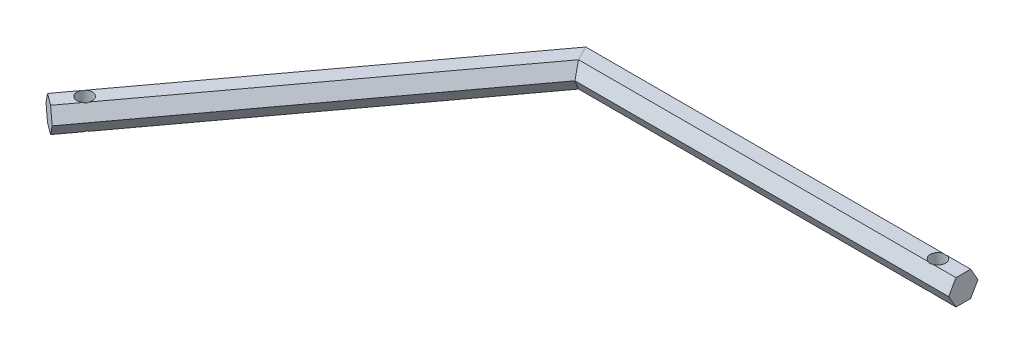
ISO-10303-21;
HEADER;
FILE_DESCRIPTION(('STEP AP214'),'2;1');
FILE_NAME('part.step','',(''),(''),'','','');
FILE_SCHEMA(('AUTOMOTIVE_DESIGN { 1 0 10303 214 1 1 1 1 }'));
ENDSEC;
DATA;
#1=APPLICATION_CONTEXT('core data for automotive mechanical design processes');
#2=APPLICATION_PROTOCOL_DEFINITION('international standard','automotive_design',2000,#1);
#3=PRODUCT_CONTEXT('',#1,'mechanical');
#4=PRODUCT('Part','Part','',(#3));
#5=PRODUCT_RELATED_PRODUCT_CATEGORY('part','',(#4));
#6=PRODUCT_DEFINITION_FORMATION('','',#4);
#7=PRODUCT_DEFINITION_CONTEXT('part definition',#1,'design');
#8=PRODUCT_DEFINITION('design','',#6,#7);
#9=PRODUCT_DEFINITION_SHAPE('','',#8);
#10=(LENGTH_UNIT() NAMED_UNIT(*) SI_UNIT(.MILLI.,.METRE.));
#11=(NAMED_UNIT(*) PLANE_ANGLE_UNIT() SI_UNIT($,.RADIAN.));
#12=(NAMED_UNIT(*) SI_UNIT($,.STERADIAN.) SOLID_ANGLE_UNIT());
#13=UNCERTAINTY_MEASURE_WITH_UNIT(LENGTH_MEASURE(1.E-05),#10,'distance_accuracy_value','');
#14=(GEOMETRIC_REPRESENTATION_CONTEXT(3) GLOBAL_UNCERTAINTY_ASSIGNED_CONTEXT((#13)) GLOBAL_UNIT_ASSIGNED_CONTEXT((#10,
#11,#12)) REPRESENTATION_CONTEXT('',''));
#15=CARTESIAN_POINT('',(0.,0.,0.));
#16=DIRECTION('',(0.,0.,1.));
#17=DIRECTION('',(1.,0.,0.));
#18=AXIS2_PLACEMENT_3D('',#15,#16,#17);
#19=CARTESIAN_POINT('',(-0.356969288863335,-5.,-4.37071207084153));
#20=DIRECTION('',(0.,-1.,0.));
#21=DIRECTION('',(1.,0.,0.));
#22=AXIS2_PLACEMENT_3D('',#19,#20,#21);
#23=PLANE('',#22);
#24=DIRECTION('',(-0.594822786751345,0.,0.803856860617215));
#25=VECTOR('',#24,1.);
#26=CARTESIAN_POINT('',(-0.356969288863335,-5.,-4.37071207084153));
#27=LINE('',#26,#25);
#28=CARTESIAN_POINT('',(-86.0813957911685,-5.,111.479201384409));
#29=VERTEX_POINT('',#28);
#30=CARTESIAN_POINT('',(-91.5439528870381,-5.,118.861423612327));
#31=VERTEX_POINT('',#30);
#32=EDGE_CURVE('E173',#29,#31,#27,.T.);
#33=ORIENTED_EDGE('',*,*,#32,.F.);
#34=CARTESIAN_POINT('',(-83.2751901451892,-5.00000000000106,112.539960486409));
#35=DIRECTION('',(0.,-1.,0.));
#36=DIRECTION('',(0.80385686061721,0.,0.594822786751351));
#37=AXIS2_PLACEMENT_3D('',#34,#35,#36);
#38=CIRCLE('',#37,2.99999999999999);
#39=CARTESIAN_POINT('',(-81.4403260424919,-5.00000000000106,114.913412344913));
#40=VERTEX_POINT('',#39);
#41=EDGE_CURVE('E63',#40,#29,#38,.T.);
#42=ORIENTED_EDGE('',*,*,#41,.F.);
#43=DIRECTION('',(-0.594822786751345,0.,0.803856860617215));
#44=VECTOR('',#43,1.);
#45=CARTESIAN_POINT('',(4.28410045980944,-5.,-0.936501110331403));
#46=LINE('',#45,#44);
#47=CARTESIAN_POINT('',(-86.9028831383654,-5.,122.295634572837));
#48=VERTEX_POINT('',#47);
#49=EDGE_CURVE('E171',#40,#48,#46,.T.);
#50=ORIENTED_EDGE('',*,*,#49,.T.);
#51=DIRECTION('',(0.803856860617215,0.,0.594822786751344));
#52=VECTOR('',#51,1.);
#53=CARTESIAN_POINT('',(-91.5439528870381,-5.,118.861423612327));
#54=LINE('',#53,#52);
#55=EDGE_CURVE('E297',#31,#48,#54,.T.);
#56=ORIENTED_EDGE('',*,*,#55,.F.);
#57=EDGE_LOOP('',(#33,#42,#50,#56));
#58=FACE_BOUND('',#57,.T.);
#59=ADVANCED_FACE('F39',(#58),#23,.T.);
#60=CARTESIAN_POINT('',(4.28410045980944,-5.,-0.936501110331403));
#61=DIRECTION('',(0.696160462300914,-0.5,0.515131644076519));
#62=DIRECTION('',(0.594822786751345,0.,-0.803856860617215));
#63=AXIS2_PLACEMENT_3D('',#60,#61,#62);
#64=PLANE('',#63);
#65=ORIENTED_EDGE('',*,*,#49,.F.);
#66=CARTESIAN_POINT('',(-83.2751901451892,-10.0000000000018,112.539960486409));
#67=DIRECTION('',(0.696160462300914,-0.5,0.515131644076519));
#68=DIRECTION('',(0.401928430308605,0.866025403784439,0.297411393375676));
#69=AXIS2_PLACEMENT_3D('',#66,#67,#68);
#70=ELLIPSE('',#69,5.99999999999997,2.99999999999999);
#71=CARTESIAN_POINT('',(-80.468984499213,-5.00000000000106,113.600719588417));
#72=VERTEX_POINT('',#71);
#73=EDGE_CURVE('E156',#40,#72,#70,.F.);
#74=ORIENTED_EDGE('',*,*,#73,.T.);
#75=CARTESIAN_POINT('',(1.45504246215553,-5.,2.88675134594813));
#76=VERTEX_POINT('',#75);
#77=EDGE_CURVE('E182',#76,#72,#46,.T.);
#78=ORIENTED_EDGE('',*,*,#77,.F.);
#79=DIRECTION('',(-0.244379400918653,-0.839767248292632,-0.484839846858383));
#80=VECTOR('',#79,1.);
#81=CARTESIAN_POINT('',(10.3263391859964,25.4846660993621,20.4870815245707));
#82=LINE('',#81,#80);
#83=CARTESIAN_POINT('',(2.91008492431101,0.,5.77350269189626));
#84=VERTEX_POINT('',#83);
#85=EDGE_CURVE('E196',#84,#76,#82,.T.);
#86=ORIENTED_EDGE('',*,*,#85,.F.);
#87=DIRECTION('',(-0.594822786751345,0.,0.803856860617215));
#88=VECTOR('',#87,1.);
#89=CARTESIAN_POINT('',(6.60463533414582,0.,0.780604369923665));
#90=LINE('',#89,#88);
#91=CARTESIAN_POINT('',(-84.582348264029,0.,124.012740053092));
#92=VERTEX_POINT('',#91);
#93=EDGE_CURVE('E183',#84,#92,#90,.T.);
#94=ORIENTED_EDGE('',*,*,#93,.T.);
#95=DIRECTION('',(0.401928430308607,0.866025403784438,0.297411393375673));
#96=VECTOR('',#95,1.);
#97=CARTESIAN_POINT('',(-86.9028831383654,-5.,122.295634572837));
#98=LINE('',#97,#96);
#99=EDGE_CURVE('E180',#48,#92,#98,.T.);
#100=ORIENTED_EDGE('',*,*,#99,.F.);
#101=EDGE_LOOP('',(#65,#74,#78,#86,#94,#100));
#102=FACE_BOUND('',#101,.T.);
#103=ADVANCED_FACE('F178',(#102),#64,.T.);
#104=CARTESIAN_POINT('',(6.60463533414582,0.,0.780604369923665));
#105=DIRECTION('',(0.696160462300914,0.5,0.515131644076519));
#106=DIRECTION('',(0.594822786751345,0.,-0.803856860617215));
#107=AXIS2_PLACEMENT_3D('',#104,#105,#106);
#108=PLANE('',#107);
#109=DIRECTION('',(-0.594822786751345,0.,0.803856860617215));
#110=VECTOR('',#109,1.);
#111=CARTESIAN_POINT('',(4.28410045980944,5.,-0.936501110331403));
#112=LINE('',#111,#110);
#113=CARTESIAN_POINT('',(1.4550424621555,5.,2.88675134594813));
#114=VERTEX_POINT('',#113);
#115=CARTESIAN_POINT('',(-80.4689844992139,4.99999999999949,113.600719588419));
#116=VERTEX_POINT('',#115);
#117=EDGE_CURVE('E187',#114,#116,#112,.T.);
#118=ORIENTED_EDGE('',*,*,#117,.T.);
#119=CARTESIAN_POINT('',(-83.2751901451892,10.0000000000019,112.539960486409));
#120=DIRECTION('',(0.696160462300914,0.5,0.515131644076519));
#121=DIRECTION('',(-0.40192843030861,0.866025403784439,-0.297411393375669));
#122=AXIS2_PLACEMENT_3D('',#119,#120,#121);
#123=ELLIPSE('',#122,6.00000000000001,2.99999999999999);
#124=CARTESIAN_POINT('',(-81.4403260424901,4.99999999999949,114.913412344911));
#125=VERTEX_POINT('',#124);
#126=EDGE_CURVE('E166',#116,#125,#123,.F.);
#127=ORIENTED_EDGE('',*,*,#126,.T.);
#128=CARTESIAN_POINT('',(-86.9028831383654,5.,122.295634572837));
#129=VERTEX_POINT('',#128);
#130=EDGE_CURVE('E308',#125,#129,#112,.T.);
#131=ORIENTED_EDGE('',*,*,#130,.T.);
#132=DIRECTION('',(-0.401928430308607,0.866025403784438,-0.297411393375673));
#133=VECTOR('',#132,1.);
#134=CARTESIAN_POINT('',(-84.582348264029,0.,124.012740053092));
#135=LINE('',#134,#133);
#136=EDGE_CURVE('E291',#92,#129,#135,.T.);
#137=ORIENTED_EDGE('',*,*,#136,.F.);
#138=ORIENTED_EDGE('',*,*,#93,.F.);
#139=DIRECTION('',(0.244379400918653,-0.839767248292632,0.484839846858383));
#140=VECTOR('',#139,1.);
#141=CARTESIAN_POINT('',(11.6944846329888,-30.1860596413953,23.20143235163));
#142=LINE('',#141,#140);
#143=EDGE_CURVE('E202',#114,#84,#142,.T.);
#144=ORIENTED_EDGE('',*,*,#143,.F.);
#145=EDGE_LOOP('',(#118,#127,#131,#137,#138,#144));
#146=FACE_BOUND('',#145,.T.);
#147=ADVANCED_FACE('F318',(#146),#108,.T.);
#148=CARTESIAN_POINT('',(4.28410045980944,5.,-0.936501110331403));
#149=DIRECTION('',(0.,1.,0.));
#150=DIRECTION('',(-1.,0.,0.));
#151=AXIS2_PLACEMENT_3D('',#148,#149,#150);
#152=PLANE('',#151);
#153=DIRECTION('',(-0.594822786751345,0.,0.803856860617215));
#154=VECTOR('',#153,1.);
#155=CARTESIAN_POINT('',(-0.356969288863321,5.00000000000001,-4.37071207084153));
#156=LINE('',#155,#154);
#157=CARTESIAN_POINT('',(-1.45504246215548,5.00000000000001,-2.88675134594812));
#158=VERTEX_POINT('',#157);
#159=CARTESIAN_POINT('',(-85.1100542478828,5.00000000000001,110.166508627904));
#160=VERTEX_POINT('',#159);
#161=EDGE_CURVE('E305',#158,#160,#156,.T.);
#162=ORIENTED_EDGE('',*,*,#161,.T.);
#163=CARTESIAN_POINT('',(-83.2751901451892,4.99999999999948,112.539960486409));
#164=DIRECTION('',(0.,-1.,0.));
#165=DIRECTION('',(0.80385686061721,0.,0.594822786751351));
#166=AXIS2_PLACEMENT_3D('',#163,#164,#165);
#167=CIRCLE('',#166,2.99999999999999);
#168=EDGE_CURVE('E55',#160,#116,#167,.T.);
#169=ORIENTED_EDGE('',*,*,#168,.T.);
#170=ORIENTED_EDGE('',*,*,#117,.F.);
#171=DIRECTION('',(0.450098441037433,0.,0.892978943411138));
#172=VECTOR('',#171,1.);
#173=CARTESIAN_POINT('',(31.5485584308173,4.99999999999999,62.5911929593927));
#174=LINE('',#173,#172);
#175=EDGE_CURVE('E209',#158,#114,#174,.T.);
#176=ORIENTED_EDGE('',*,*,#175,.F.);
#177=EDGE_LOOP('',(#162,#169,#170,#176));
#178=FACE_BOUND('',#177,.T.);
#179=ADVANCED_FACE('F356',(#178),#152,.T.);
#180=CARTESIAN_POINT('',(-0.356969288863321,5.00000000000001,-4.37071207084153));
#181=DIRECTION('',(-0.696160462300914,0.500000000000001,-0.515131644076518));
#182=DIRECTION('',(-0.594822786751345,0.,0.803856860617215));
#183=AXIS2_PLACEMENT_3D('',#180,#181,#182);
#184=PLANE('',#183);
#185=CARTESIAN_POINT('',(-86.081395791167,4.99999999999948,111.479201384406));
#186=VERTEX_POINT('',#185);
#187=CARTESIAN_POINT('',(-91.5439528870381,5.00000000000001,118.861423612327));
#188=VERTEX_POINT('',#187);
#189=EDGE_CURVE('E304',#186,#188,#156,.T.);
#190=ORIENTED_EDGE('',*,*,#189,.F.);
#191=CARTESIAN_POINT('',(-83.2751901451892,9.99999999999815,112.539960486409));
#192=DIRECTION('',(-0.696160462300914,0.500000000000001,-0.515131644076518));
#193=DIRECTION('',(0.401928430308606,0.866025403784438,0.297411393375677));
#194=AXIS2_PLACEMENT_3D('',#191,#192,#193);
#195=ELLIPSE('',#194,5.99999999999996,2.99999999999999);
#196=EDGE_CURVE('E175',#186,#160,#195,.F.);
#197=ORIENTED_EDGE('',*,*,#196,.T.);
#198=ORIENTED_EDGE('',*,*,#161,.F.);
#199=DIRECTION('',(0.244379400918654,0.839767248292632,0.484839846858384));
#200=VECTOR('',#199,1.);
#201=CARTESIAN_POINT('',(7.59004829201163,36.0818790152958,15.0583798704524));
#202=LINE('',#201,#200);
#203=CARTESIAN_POINT('',(-2.91008492431103,0.,-5.77350269189627));
#204=VERTEX_POINT('',#203);
#205=EDGE_CURVE('E218',#204,#158,#202,.T.);
#206=ORIENTED_EDGE('',*,*,#205,.F.);
#207=DIRECTION('',(-0.594822786751345,0.,0.803856860617215));
#208=VECTOR('',#207,1.);
#209=CARTESIAN_POINT('',(-2.67750416319971,0.,-6.08781755109659));
#210=LINE('',#209,#208);
#211=CARTESIAN_POINT('',(-93.8644877613745,0.,117.144318132072));
#212=VERTEX_POINT('',#211);
#213=EDGE_CURVE('E300',#204,#212,#210,.T.);
#214=ORIENTED_EDGE('',*,*,#213,.T.);
#215=DIRECTION('',(-0.401928430308609,-0.866025403784438,-0.297411393375673));
#216=VECTOR('',#215,1.);
#217=CARTESIAN_POINT('',(-91.5439528870381,5.00000000000001,118.861423612327));
#218=LINE('',#217,#216);
#219=EDGE_CURVE('E284',#188,#212,#218,.T.);
#220=ORIENTED_EDGE('',*,*,#219,.F.);
#221=EDGE_LOOP('',(#190,#197,#198,#206,#214,#220));
#222=FACE_BOUND('',#221,.T.);
#223=ADVANCED_FACE('F359',(#222),#184,.T.);
#224=CARTESIAN_POINT('',(-2.67750416319971,0.,-6.08781755109659));
#225=DIRECTION('',(-0.696160462300914,-0.5,-0.515131644076519));
#226=DIRECTION('',(-0.594822786751345,0.,0.803856860617215));
#227=AXIS2_PLACEMENT_3D('',#224,#225,#226);
#228=PLANE('',#227);
#229=CARTESIAN_POINT('',(-1.45504246215548,-5.,-2.88675134594813));
#230=VERTEX_POINT('',#229);
#231=CARTESIAN_POINT('',(-85.1100542478804,-5.00000000000106,110.166508627901));
#232=VERTEX_POINT('',#231);
#233=EDGE_CURVE('E191',#230,#232,#27,.T.);
#234=ORIENTED_EDGE('',*,*,#233,.T.);
#235=CARTESIAN_POINT('',(-83.2751901451892,-9.9999999999982,112.539960486409));
#236=DIRECTION('',(-0.696160462300914,-0.5,-0.515131644076519));
#237=DIRECTION('',(-0.40192843030861,0.866025403784439,-0.297411393375669));
#238=AXIS2_PLACEMENT_3D('',#235,#236,#237);
#239=ELLIPSE('',#238,6.,2.99999999999999);
#240=EDGE_CURVE('E11',#232,#29,#239,.F.);
#241=ORIENTED_EDGE('',*,*,#240,.T.);
#242=ORIENTED_EDGE('',*,*,#32,.T.);
#243=DIRECTION('',(0.401928430308607,-0.866025403784438,0.297411393375673));
#244=VECTOR('',#243,1.);
#245=CARTESIAN_POINT('',(-93.8644877613745,0.,117.144318132072));
#246=LINE('',#245,#244);
#247=EDGE_CURVE('E280',#212,#31,#246,.T.);
#248=ORIENTED_EDGE('',*,*,#247,.F.);
#249=ORIENTED_EDGE('',*,*,#213,.F.);
#250=DIRECTION('',(-0.244379400918653,0.839767248292632,-0.484839846858383));
#251=VECTOR('',#250,1.);
#252=CARTESIAN_POINT('',(6.22190284501917,-31.3804854732625,12.344029043393));
#253=LINE('',#252,#251);
#254=EDGE_CURVE('E222',#230,#204,#253,.T.);
#255=ORIENTED_EDGE('',*,*,#254,.F.);
#256=EDGE_LOOP('',(#234,#241,#242,#248,#249,#255));
#257=FACE_BOUND('',#256,.T.);
#258=ADVANCED_FACE('F374',(#257),#228,.T.);
#259=CARTESIAN_POINT('',(150.,5.,2.88675134594814));
#260=DIRECTION('',(0.,1.,0.));
#261=DIRECTION('',(0.,0.,1.));
#262=AXIS2_PLACEMENT_3D('',#259,#260,#261);
#263=PLANE('',#262);
#264=CARTESIAN_POINT('',(140.,5.,0.));
#265=DIRECTION('',(0.,1.,0.));
#266=DIRECTION('',(0.,0.,1.));
#267=AXIS2_PLACEMENT_3D('',#264,#265,#266);
#268=CIRCLE('',#267,2.99999999999999);
#269=CARTESIAN_POINT('',(140.816496580928,5.,2.88675134594813));
#270=VERTEX_POINT('',#269);
#271=CARTESIAN_POINT('',(140.816496580928,5.00000000000001,-2.88675134594811));
#272=VERTEX_POINT('',#271);
#273=EDGE_CURVE('E343',#270,#272,#268,.T.);
#274=ORIENTED_EDGE('',*,*,#273,.F.);
#275=DIRECTION('',(-1.,0.,0.));
#276=VECTOR('',#275,1.);
#277=CARTESIAN_POINT('',(150.,5.,2.88675134594814));
#278=LINE('',#277,#276);
#279=CARTESIAN_POINT('',(150.,5.,2.88675134594814));
#280=VERTEX_POINT('',#279);
#281=EDGE_CURVE('E253',#280,#270,#278,.T.);
#282=ORIENTED_EDGE('',*,*,#281,.F.);
#283=DIRECTION('',(0.,0.,-1.));
#284=VECTOR('',#283,1.);
#285=CARTESIAN_POINT('',(150.,5.,2.88675134594814));
#286=LINE('',#285,#284);
#287=CARTESIAN_POINT('',(150.,5.00000000000001,-2.88675134594811));
#288=VERTEX_POINT('',#287);
#289=EDGE_CURVE('E252',#280,#288,#286,.T.);
#290=ORIENTED_EDGE('',*,*,#289,.T.);
#291=DIRECTION('',(-1.,0.,0.));
#292=VECTOR('',#291,1.);
#293=CARTESIAN_POINT('',(150.,5.00000000000001,-2.88675134594811));
#294=LINE('',#293,#292);
#295=EDGE_CURVE('E262',#288,#272,#294,.T.);
#296=ORIENTED_EDGE('',*,*,#295,.T.);
#297=EDGE_LOOP('',(#274,#282,#290,#296));
#298=FACE_BOUND('',#297,.T.);
#299=ADVANCED_FACE('F400',(#298),#263,.T.);
#300=CARTESIAN_POINT('',(150.,-5.,-2.88675134594812));
#301=DIRECTION('',(0.,-1.,0.));
#302=DIRECTION('',(0.,0.,-1.));
#303=AXIS2_PLACEMENT_3D('',#300,#301,#302);
#304=PLANE('',#303);
#305=CARTESIAN_POINT('',(140.,-5.00000000000001,0.));
#306=DIRECTION('',(0.,1.,0.));
#307=DIRECTION('',(0.,0.,1.));
#308=AXIS2_PLACEMENT_3D('',#305,#306,#307);
#309=CIRCLE('',#308,2.99999999999999);
#310=CARTESIAN_POINT('',(140.816496580928,-5.00000000000001,2.88675134594814));
#311=VERTEX_POINT('',#310);
#312=CARTESIAN_POINT('',(140.816496580928,-5.00000000000001,-2.88675134594812));
#313=VERTEX_POINT('',#312);
#314=EDGE_CURVE('E339',#311,#313,#309,.T.);
#315=ORIENTED_EDGE('',*,*,#314,.T.);
#316=DIRECTION('',(-1.,0.,0.));
#317=VECTOR('',#316,1.);
#318=CARTESIAN_POINT('',(150.,-5.,-2.88675134594812));
#319=LINE('',#318,#317);
#320=CARTESIAN_POINT('',(150.,-5.,-2.88675134594812));
#321=VERTEX_POINT('',#320);
#322=EDGE_CURVE('E237',#321,#313,#319,.T.);
#323=ORIENTED_EDGE('',*,*,#322,.F.);
#324=DIRECTION('',(0.,0.,1.));
#325=VECTOR('',#324,1.);
#326=CARTESIAN_POINT('',(150.,-5.,-2.88675134594812));
#327=LINE('',#326,#325);
#328=CARTESIAN_POINT('',(150.,-5.,2.88675134594814));
#329=VERTEX_POINT('',#328);
#330=EDGE_CURVE('E194',#321,#329,#327,.T.);
#331=ORIENTED_EDGE('',*,*,#330,.T.);
#332=DIRECTION('',(-1.,0.,0.));
#333=VECTOR('',#332,1.);
#334=CARTESIAN_POINT('',(150.,-5.,2.88675134594814));
#335=LINE('',#334,#333);
#336=EDGE_CURVE('E231',#329,#311,#335,.T.);
#337=ORIENTED_EDGE('',*,*,#336,.T.);
#338=EDGE_LOOP('',(#315,#323,#331,#337));
#339=FACE_BOUND('',#338,.T.);
#340=ADVANCED_FACE('F405',(#339),#304,.T.);
#341=CARTESIAN_POINT('',(-89.2234180127016,-2.83636996241576E-13,120.578529092582));
#342=DIRECTION('',(-0.594822786751344,0.,0.803856860617215));
#343=DIRECTION('',(0.803856860617215,0.,0.594822786751344));
#344=AXIS2_PLACEMENT_3D('',#341,#342,#343);
#345=PLANE('',#344);
#346=ORIENTED_EDGE('',*,*,#55,.T.);
#347=ORIENTED_EDGE('',*,*,#99,.T.);
#348=ORIENTED_EDGE('',*,*,#136,.T.);
#349=DIRECTION('',(-0.803856860617215,0.,-0.594822786751345));
#350=VECTOR('',#349,1.);
#351=CARTESIAN_POINT('',(-86.9028831383654,5.,122.295634572837));
#352=LINE('',#351,#350);
#353=EDGE_CURVE('E287',#129,#188,#352,.T.);
#354=ORIENTED_EDGE('',*,*,#353,.T.);
#355=ORIENTED_EDGE('',*,*,#219,.T.);
#356=ORIENTED_EDGE('',*,*,#247,.T.);
#357=EDGE_LOOP('',(#346,#347,#348,#354,#355,#356));
#358=FACE_BOUND('',#357,.T.);
#359=ADVANCED_FACE('F41',(#358),#345,.T.);
#360=CARTESIAN_POINT('',(150.,-2.83636996241576E-13,2.4980018054066E-13));
#361=DIRECTION('',(-1.,0.,0.));
#362=DIRECTION('',(0.,0.,1.));
#363=AXIS2_PLACEMENT_3D('',#360,#361,#362);
#364=PLANE('',#363);
#365=ORIENTED_EDGE('',*,*,#330,.F.);
#366=DIRECTION('',(0.,-0.866025403784438,0.5));
#367=VECTOR('',#366,1.);
#368=CARTESIAN_POINT('',(150.,0.,-5.77350269189626));
#369=LINE('',#368,#367);
#370=CARTESIAN_POINT('',(150.,0.,-5.77350269189626));
#371=VERTEX_POINT('',#370);
#372=EDGE_CURVE('E270',#371,#321,#369,.T.);
#373=ORIENTED_EDGE('',*,*,#372,.F.);
#374=DIRECTION('',(0.,-0.866025403784438,-0.500000000000001));
#375=VECTOR('',#374,1.);
#376=CARTESIAN_POINT('',(150.,5.00000000000001,-2.88675134594811));
#377=LINE('',#376,#375);
#378=EDGE_CURVE('E261',#288,#371,#377,.T.);
#379=ORIENTED_EDGE('',*,*,#378,.F.);
#380=ORIENTED_EDGE('',*,*,#289,.F.);
#381=DIRECTION('',(0.,0.866025403784438,-0.5));
#382=VECTOR('',#381,1.);
#383=CARTESIAN_POINT('',(150.,0.,5.77350269189626));
#384=LINE('',#383,#382);
#385=CARTESIAN_POINT('',(150.,0.,5.77350269189626));
#386=VERTEX_POINT('',#385);
#387=EDGE_CURVE('E245',#386,#280,#384,.T.);
#388=ORIENTED_EDGE('',*,*,#387,.F.);
#389=DIRECTION('',(0.,0.866025403784438,0.5));
#390=VECTOR('',#389,1.);
#391=CARTESIAN_POINT('',(150.,-5.,2.88675134594814));
#392=LINE('',#391,#390);
#393=EDGE_CURVE('E230',#329,#386,#392,.T.);
#394=ORIENTED_EDGE('',*,*,#393,.F.);
#395=EDGE_LOOP('',(#365,#373,#379,#380,#388,#394));
#396=FACE_BOUND('',#395,.T.);
#397=ADVANCED_FACE('F402',(#396),#364,.F.);
#398=ORIENTED_EDGE('',*,*,#77,.T.);
#399=EDGE_CURVE('E159',#232,#72,#38,.T.);
#400=ORIENTED_EDGE('',*,*,#399,.F.);
#401=ORIENTED_EDGE('',*,*,#233,.F.);
#402=DIRECTION('',(-0.450098441037433,0.,-0.892978943411138));
#403=VECTOR('',#402,1.);
#404=CARTESIAN_POINT('',(29.2280235564809,-5.00000000000003,57.9873361331895));
#405=LINE('',#404,#403);
#406=EDGE_CURVE('E226',#76,#230,#405,.T.);
#407=ORIENTED_EDGE('',*,*,#406,.F.);
#408=EDGE_LOOP('',(#398,#400,#401,#407));
#409=FACE_BOUND('',#408,.T.);
#410=ADVANCED_FACE('F378',(#409),#23,.T.);
#411=ORIENTED_EDGE('',*,*,#130,.F.);
#412=EDGE_CURVE('E327',#125,#186,#167,.T.);
#413=ORIENTED_EDGE('',*,*,#412,.T.);
#414=ORIENTED_EDGE('',*,*,#189,.T.);
#415=ORIENTED_EDGE('',*,*,#353,.F.);
#416=EDGE_LOOP('',(#411,#413,#414,#415));
#417=FACE_BOUND('',#416,.T.);
#418=ADVANCED_FACE('F325',(#417),#152,.T.);
#419=CARTESIAN_POINT('',(150.,0.,-5.77350269189626));
#420=DIRECTION('',(0.,-0.5,-0.866025403784438));
#421=DIRECTION('',(0.,0.866025403784439,-0.5));
#422=AXIS2_PLACEMENT_3D('',#419,#420,#421);
#423=PLANE('',#422);
#424=CARTESIAN_POINT('',(140.,-10.,0.));
#425=DIRECTION('',(0.,-0.5,-0.866025403784438));
#426=DIRECTION('',(0.,0.866025403784439,-0.5));
#427=AXIS2_PLACEMENT_3D('',#424,#425,#426);
#428=ELLIPSE('',#427,5.99999999999999,2.99999999999999);
#429=CARTESIAN_POINT('',(139.183503419072,-5.00000000000001,-2.88675134594812));
#430=VERTEX_POINT('',#429);
#431=EDGE_CURVE('E212',#430,#313,#428,.T.);
#432=ORIENTED_EDGE('',*,*,#431,.F.);
#433=EDGE_CURVE('E241',#430,#230,#319,.T.);
#434=ORIENTED_EDGE('',*,*,#433,.T.);
#435=ORIENTED_EDGE('',*,*,#254,.T.);
#436=DIRECTION('',(-1.,0.,0.));
#437=VECTOR('',#436,1.);
#438=CARTESIAN_POINT('',(150.,0.,-5.77350269189626));
#439=LINE('',#438,#437);
#440=EDGE_CURVE('E266',#371,#204,#439,.T.);
#441=ORIENTED_EDGE('',*,*,#440,.F.);
#442=ORIENTED_EDGE('',*,*,#372,.T.);
#443=ORIENTED_EDGE('',*,*,#322,.T.);
#444=EDGE_LOOP('',(#432,#434,#435,#441,#442,#443));
#445=FACE_BOUND('',#444,.T.);
#446=ADVANCED_FACE('F368',(#445),#423,.T.);
#447=CARTESIAN_POINT('',(150.,5.00000000000001,-2.88675134594811));
#448=DIRECTION('',(0.,0.500000000000001,-0.866025403784438));
#449=DIRECTION('',(0.,0.866025403784438,0.500000000000001));
#450=AXIS2_PLACEMENT_3D('',#447,#448,#449);
#451=PLANE('',#450);
#452=CARTESIAN_POINT('',(140.,9.99999999999998,0.));
#453=DIRECTION('',(0.,0.500000000000001,-0.866025403784438));
#454=DIRECTION('',(0.,0.866025403784438,0.500000000000001));
#455=AXIS2_PLACEMENT_3D('',#452,#453,#454);
#456=ELLIPSE('',#455,5.99999999999998,2.99999999999999);
#457=CARTESIAN_POINT('',(139.183503419072,5.00000000000001,-2.88675134594811));
#458=VERTEX_POINT('',#457);
#459=EDGE_CURVE('E332',#272,#458,#456,.T.);
#460=ORIENTED_EDGE('',*,*,#459,.F.);
#461=ORIENTED_EDGE('',*,*,#295,.F.);
#462=ORIENTED_EDGE('',*,*,#378,.T.);
#463=ORIENTED_EDGE('',*,*,#440,.T.);
#464=ORIENTED_EDGE('',*,*,#205,.T.);
#465=EDGE_CURVE('E257',#458,#158,#294,.T.);
#466=ORIENTED_EDGE('',*,*,#465,.F.);
#467=EDGE_LOOP('',(#460,#461,#462,#463,#464,#466));
#468=FACE_BOUND('',#467,.T.);
#469=ADVANCED_FACE('F364',(#468),#451,.T.);
#470=CARTESIAN_POINT('',(139.183503419072,5.,2.88675134594814));
#471=VERTEX_POINT('',#470);
#472=EDGE_CURVE('E165',#458,#471,#268,.T.);
#473=ORIENTED_EDGE('',*,*,#472,.F.);
#474=ORIENTED_EDGE('',*,*,#465,.T.);
#475=ORIENTED_EDGE('',*,*,#175,.T.);
#476=EDGE_CURVE('E248',#471,#114,#278,.T.);
#477=ORIENTED_EDGE('',*,*,#476,.F.);
#478=EDGE_LOOP('',(#473,#474,#475,#477));
#479=FACE_BOUND('',#478,.T.);
#480=ADVANCED_FACE('F389',(#479),#263,.T.);
#481=CARTESIAN_POINT('',(150.,0.,5.77350269189626));
#482=DIRECTION('',(0.,0.5,0.866025403784438));
#483=DIRECTION('',(0.,-0.866025403784439,0.5));
#484=AXIS2_PLACEMENT_3D('',#481,#482,#483);
#485=PLANE('',#484);
#486=CARTESIAN_POINT('',(140.,9.99999999999998,0.));
#487=DIRECTION('',(0.,0.5,0.866025403784438));
#488=DIRECTION('',(0.,0.866025403784439,-0.5));
#489=AXIS2_PLACEMENT_3D('',#486,#487,#488);
#490=ELLIPSE('',#489,5.99999999999999,2.99999999999999);
#491=EDGE_CURVE('E334',#471,#270,#490,.T.);
#492=ORIENTED_EDGE('',*,*,#491,.F.);
#493=ORIENTED_EDGE('',*,*,#476,.T.);
#494=ORIENTED_EDGE('',*,*,#143,.T.);
#495=DIRECTION('',(-1.,0.,0.));
#496=VECTOR('',#495,1.);
#497=CARTESIAN_POINT('',(150.,0.,5.77350269189626));
#498=LINE('',#497,#496);
#499=EDGE_CURVE('E235',#386,#84,#498,.T.);
#500=ORIENTED_EDGE('',*,*,#499,.F.);
#501=ORIENTED_EDGE('',*,*,#387,.T.);
#502=ORIENTED_EDGE('',*,*,#281,.T.);
#503=EDGE_LOOP('',(#492,#493,#494,#500,#501,#502));
#504=FACE_BOUND('',#503,.T.);
#505=ADVANCED_FACE('F396',(#504),#485,.T.);
#506=CARTESIAN_POINT('',(150.,-5.,2.88675134594814));
#507=DIRECTION('',(0.,-0.5,0.866025403784438));
#508=DIRECTION('',(0.,-0.866025403784439,-0.5));
#509=AXIS2_PLACEMENT_3D('',#506,#507,#508);
#510=PLANE('',#509);
#511=CARTESIAN_POINT('',(140.,-10.,0.));
#512=DIRECTION('',(0.,-0.5,0.866025403784438));
#513=DIRECTION('',(0.,0.866025403784439,0.5));
#514=AXIS2_PLACEMENT_3D('',#511,#512,#513);
#515=ELLIPSE('',#514,5.99999999999999,2.99999999999999);
#516=CARTESIAN_POINT('',(139.183503419072,-5.,2.88675134594814));
#517=VERTEX_POINT('',#516);
#518=EDGE_CURVE('E336',#311,#517,#515,.T.);
#519=ORIENTED_EDGE('',*,*,#518,.F.);
#520=ORIENTED_EDGE('',*,*,#336,.F.);
#521=ORIENTED_EDGE('',*,*,#393,.T.);
#522=ORIENTED_EDGE('',*,*,#499,.T.);
#523=ORIENTED_EDGE('',*,*,#85,.T.);
#524=EDGE_CURVE('E236',#517,#76,#335,.T.);
#525=ORIENTED_EDGE('',*,*,#524,.F.);
#526=EDGE_LOOP('',(#519,#520,#521,#522,#523,#525));
#527=FACE_BOUND('',#526,.T.);
#528=ADVANCED_FACE('F406',(#527),#510,.T.);
#529=CARTESIAN_POINT('',(140.,-5.,0.));
#530=DIRECTION('',(0.,-1.,0.));
#531=DIRECTION('',(0.,0.,-1.));
#532=AXIS2_PLACEMENT_3D('',#529,#530,#531);
#533=CIRCLE('',#532,2.99999999999999);
#534=EDGE_CURVE('E48',#517,#430,#533,.T.);
#535=ORIENTED_EDGE('',*,*,#534,.F.);
#536=ORIENTED_EDGE('',*,*,#524,.T.);
#537=ORIENTED_EDGE('',*,*,#406,.T.);
#538=ORIENTED_EDGE('',*,*,#433,.F.);
#539=EDGE_LOOP('',(#535,#536,#537,#538));
#540=FACE_BOUND('',#539,.T.);
#541=ADVANCED_FACE('F380',(#540),#304,.T.);
#542=CARTESIAN_POINT('',(140.,-5.00000000000001,0.));
#543=DIRECTION('',(0.,1.,0.));
#544=DIRECTION('',(0.,0.,1.));
#545=AXIS2_PLACEMENT_3D('',#542,#543,#544);
#546=CYLINDRICAL_SURFACE('',#545,2.99999999999999);
#547=ORIENTED_EDGE('',*,*,#431,.T.);
#548=ORIENTED_EDGE('',*,*,#314,.F.);
#549=ORIENTED_EDGE('',*,*,#518,.T.);
#550=ORIENTED_EDGE('',*,*,#534,.T.);
#551=EDGE_LOOP('',(#547,#548,#549,#550));
#552=FACE_BOUND('',#551,.T.);
#553=ORIENTED_EDGE('',*,*,#459,.T.);
#554=ORIENTED_EDGE('',*,*,#472,.T.);
#555=ORIENTED_EDGE('',*,*,#491,.T.);
#556=ORIENTED_EDGE('',*,*,#273,.T.);
#557=EDGE_LOOP('',(#553,#554,#555,#556));
#558=FACE_BOUND('',#557,.T.);
#559=ADVANCED_FACE('F393',(#552,#558),#546,.F.);
#560=CARTESIAN_POINT('',(-83.2751901451892,-5.00000000000106,112.539960486409));
#561=DIRECTION('',(0.,1.,0.));
#562=DIRECTION('',(-1.,0.,0.));
#563=AXIS2_PLACEMENT_3D('',#560,#561,#562);
#564=CYLINDRICAL_SURFACE('',#563,2.99999999999999);
#565=ORIENTED_EDGE('',*,*,#41,.T.);
#566=ORIENTED_EDGE('',*,*,#240,.F.);
#567=ORIENTED_EDGE('',*,*,#399,.T.);
#568=ORIENTED_EDGE('',*,*,#73,.F.);
#569=EDGE_LOOP('',(#565,#566,#567,#568));
#570=FACE_BOUND('',#569,.T.);
#571=ORIENTED_EDGE('',*,*,#168,.F.);
#572=ORIENTED_EDGE('',*,*,#196,.F.);
#573=ORIENTED_EDGE('',*,*,#412,.F.);
#574=ORIENTED_EDGE('',*,*,#126,.F.);
#575=EDGE_LOOP('',(#571,#572,#573,#574));
#576=FACE_BOUND('',#575,.T.);
#577=ADVANCED_FACE('F157',(#570,#576),#564,.F.);
#578=CLOSED_SHELL('',(#59,#103,#147,#179,#223,#258,#299,#340,#359,#397,#410,#418,#446,#469,#480,
#505,#528,#541,#559,#577));
#579=MANIFOLD_SOLID_BREP('B2',#578);
#580=ADVANCED_BREP_SHAPE_REPRESENTATION('',(#18,#579),#14);
#581=SHAPE_DEFINITION_REPRESENTATION(#9,#580);
ENDSEC;
END-ISO-10303-21;
